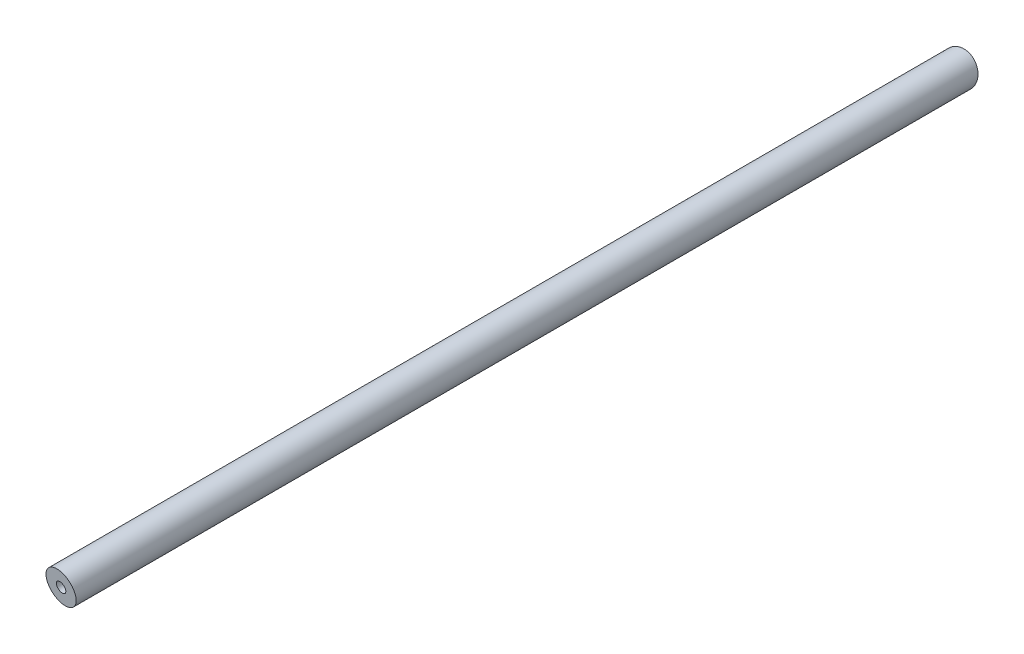
ISO-10303-21;
HEADER;
FILE_DESCRIPTION(('STEP AP214'),'2;1');
FILE_NAME('part.step','',(''),(''),'','','');
FILE_SCHEMA(('AUTOMOTIVE_DESIGN { 1 0 10303 214 1 1 1 1 }'));
ENDSEC;
DATA;
#1=APPLICATION_CONTEXT('core data for automotive mechanical design processes');
#2=APPLICATION_PROTOCOL_DEFINITION('international standard','automotive_design',2000,#1);
#3=PRODUCT_CONTEXT('',#1,'mechanical');
#4=PRODUCT('Part','Part','',(#3));
#5=PRODUCT_RELATED_PRODUCT_CATEGORY('part','',(#4));
#6=PRODUCT_DEFINITION_FORMATION('','',#4);
#7=PRODUCT_DEFINITION_CONTEXT('part definition',#1,'design');
#8=PRODUCT_DEFINITION('design','',#6,#7);
#9=PRODUCT_DEFINITION_SHAPE('','',#8);
#10=(LENGTH_UNIT() NAMED_UNIT(*) SI_UNIT(.MILLI.,.METRE.));
#11=(NAMED_UNIT(*) PLANE_ANGLE_UNIT() SI_UNIT($,.RADIAN.));
#12=(NAMED_UNIT(*) SI_UNIT($,.STERADIAN.) SOLID_ANGLE_UNIT());
#13=UNCERTAINTY_MEASURE_WITH_UNIT(LENGTH_MEASURE(1.E-05),#10,'distance_accuracy_value','');
#14=(GEOMETRIC_REPRESENTATION_CONTEXT(3) GLOBAL_UNCERTAINTY_ASSIGNED_CONTEXT((#13)) GLOBAL_UNIT_ASSIGNED_CONTEXT((#10,
#11,#12)) REPRESENTATION_CONTEXT('',''));
#15=CARTESIAN_POINT('',(0.,0.,0.));
#16=DIRECTION('',(0.,0.,1.));
#17=DIRECTION('',(1.,0.,0.));
#18=AXIS2_PLACEMENT_3D('',#15,#16,#17);
#19=CARTESIAN_POINT('',(280.162497210028,77.0644128198302,208.913539312122));
#20=DIRECTION('',(0.,0.,-1.));
#21=DIRECTION('',(-1.,0.,0.));
#22=AXIS2_PLACEMENT_3D('',#19,#20,#21);
#23=CYLINDRICAL_SURFACE('',#22,7.99999999999999);
#24=CARTESIAN_POINT('',(280.162497210028,77.0644128198302,186.097238787275));
#25=DIRECTION('',(0.0938844589969342,0.154136197301286,-0.983579046665977));
#26=DIRECTION('',(-0.511657137590325,-0.840020663194202,-0.180477862796654));
#27=AXIS2_PLACEMENT_3D('',#24,#25,#26);
#28=ELLIPSE('',#27,8.13356082270913,7.99999999999999);
#29=CARTESIAN_POINT('',(276.000902761064,70.2320536634077,184.629311113066));
#30=VERTEX_POINT('',#29);
#31=EDGE_CURVE('E11',#30,#30,#28,.T.);
#32=ORIENTED_EDGE('',*,*,#31,.T.);
#33=EDGE_LOOP('',(#32));
#34=FACE_BOUND('',#33,.T.);
#35=CARTESIAN_POINT('',(280.162497210028,77.0644128198302,-251.158250432089));
#36=DIRECTION('',(0.0938844589969341,0.154136197301286,0.983579046665977));
#37=DIRECTION('',(-0.511657137590325,-0.840020663194203,0.180477862796654));
#38=AXIS2_PLACEMENT_3D('',#35,#36,#37);
#39=ELLIPSE('',#38,8.13356082270913,7.99999999999999);
#40=CARTESIAN_POINT('',(276.000902761064,70.2320536634077,-249.69032275788));
#41=VERTEX_POINT('',#40);
#42=EDGE_CURVE('E42',#41,#41,#39,.F.);
#43=ORIENTED_EDGE('',*,*,#42,.F.);
#44=EDGE_LOOP('',(#43));
#45=FACE_BOUND('',#44,.T.);
#46=ADVANCED_FACE('F35',(#34,#45),#23,.T.);
#47=CARTESIAN_POINT('',(701.025754215898,-617.21332782363,117.469494177593));
#48=DIRECTION('',(0.0938844589969342,0.154136197301286,-0.983579046665977));
#49=DIRECTION('',(0.722068345922334,0.669619674598515,0.173858549423269));
#50=AXIS2_PLACEMENT_3D('',#47,#48,#49);
#51=PLANE('',#50);
#52=CARTESIAN_POINT('',(280.162497210028,77.0644128198302,186.097238787275));
#53=DIRECTION('',(0.0938844589969342,0.154136197301286,-0.983579046665977));
#54=DIRECTION('',(0.511657137590325,0.840020663194202,0.180477862796654));
#55=AXIS2_PLACEMENT_3D('',#52,#53,#54);
#56=ELLIPSE('',#55,2.54173775709661,2.5);
#57=CARTESIAN_POINT('',(281.462995475329,79.1995250562122,186.555966185466));
#58=VERTEX_POINT('',#57);
#59=EDGE_CURVE('E38',#58,#58,#56,.T.);
#60=ORIENTED_EDGE('',*,*,#59,.T.);
#61=EDGE_LOOP('',(#60));
#62=FACE_BOUND('',#61,.T.);
#63=ORIENTED_EDGE('',*,*,#31,.F.);
#64=EDGE_LOOP('',(#63));
#65=FACE_BOUND('',#64,.T.);
#66=ADVANCED_FACE('F63',(#62,#65),#51,.F.);
#67=CARTESIAN_POINT('',(976.746434686529,-365.999261381638,-248.216195294149));
#68=DIRECTION('',(0.0938844589969341,0.154136197301286,0.983579046665977));
#69=DIRECTION('',(-0.722068345922334,-0.669619674598515,0.173858549423269));
#70=AXIS2_PLACEMENT_3D('',#67,#68,#69);
#71=PLANE('',#70);
#72=ORIENTED_EDGE('',*,*,#42,.T.);
#73=EDGE_LOOP('',(#72));
#74=FACE_BOUND('',#73,.T.);
#75=ADVANCED_FACE('F60',(#74),#71,.F.);
#76=CARTESIAN_POINT('',(280.162497210028,77.0644128198302,188.));
#77=DIRECTION('',(0.,0.,1.));
#78=DIRECTION('',(1.,0.,0.));
#79=AXIS2_PLACEMENT_3D('',#76,#77,#78);
#80=CYLINDRICAL_SURFACE('',#79,2.5);
#81=CARTESIAN_POINT('',(280.162497210028,77.0644128198302,173.));
#82=DIRECTION('',(0.,0.,1.));
#83=DIRECTION('',(1.,0.,0.));
#84=AXIS2_PLACEMENT_3D('',#81,#82,#83);
#85=CIRCLE('',#84,2.5);
#86=CARTESIAN_POINT('',(282.662497210028,77.0644128198302,173.));
#87=VERTEX_POINT('',#86);
#88=EDGE_CURVE('E52',#87,#87,#85,.T.);
#89=ORIENTED_EDGE('',*,*,#88,.F.);
#90=EDGE_LOOP('',(#89));
#91=FACE_BOUND('',#90,.T.);
#92=ORIENTED_EDGE('',*,*,#59,.F.);
#93=EDGE_LOOP('',(#92));
#94=FACE_BOUND('',#93,.T.);
#95=ADVANCED_FACE('F48',(#91,#94),#80,.F.);
#96=CARTESIAN_POINT('',(280.162497210028,77.0644128198302,173.));
#97=DIRECTION('',(0.,0.,1.));
#98=DIRECTION('',(1.,0.,0.));
#99=AXIS2_PLACEMENT_3D('',#96,#97,#98);
#100=CONICAL_SURFACE('',#99,2.5,1.02974425867666);
#101=CARTESIAN_POINT('',(280.162497210028,77.0644128198302,171.497848452431));
#102=VERTEX_POINT('',#101);
#103=VERTEX_LOOP('',#102);
#104=FACE_BOUND('',#103,.T.);
#105=ORIENTED_EDGE('',*,*,#88,.T.);
#106=EDGE_LOOP('',(#105));
#107=FACE_BOUND('',#106,.T.);
#108=ADVANCED_FACE('F45',(#104,#107),#100,.F.);
#109=CLOSED_SHELL('',(#46,#66,#75,#95,#108));
#110=MANIFOLD_SOLID_BREP('B2',#109);
#111=ADVANCED_BREP_SHAPE_REPRESENTATION('',(#18,#110),#14);
#112=SHAPE_DEFINITION_REPRESENTATION(#9,#111);
ENDSEC;
END-ISO-10303-21;
